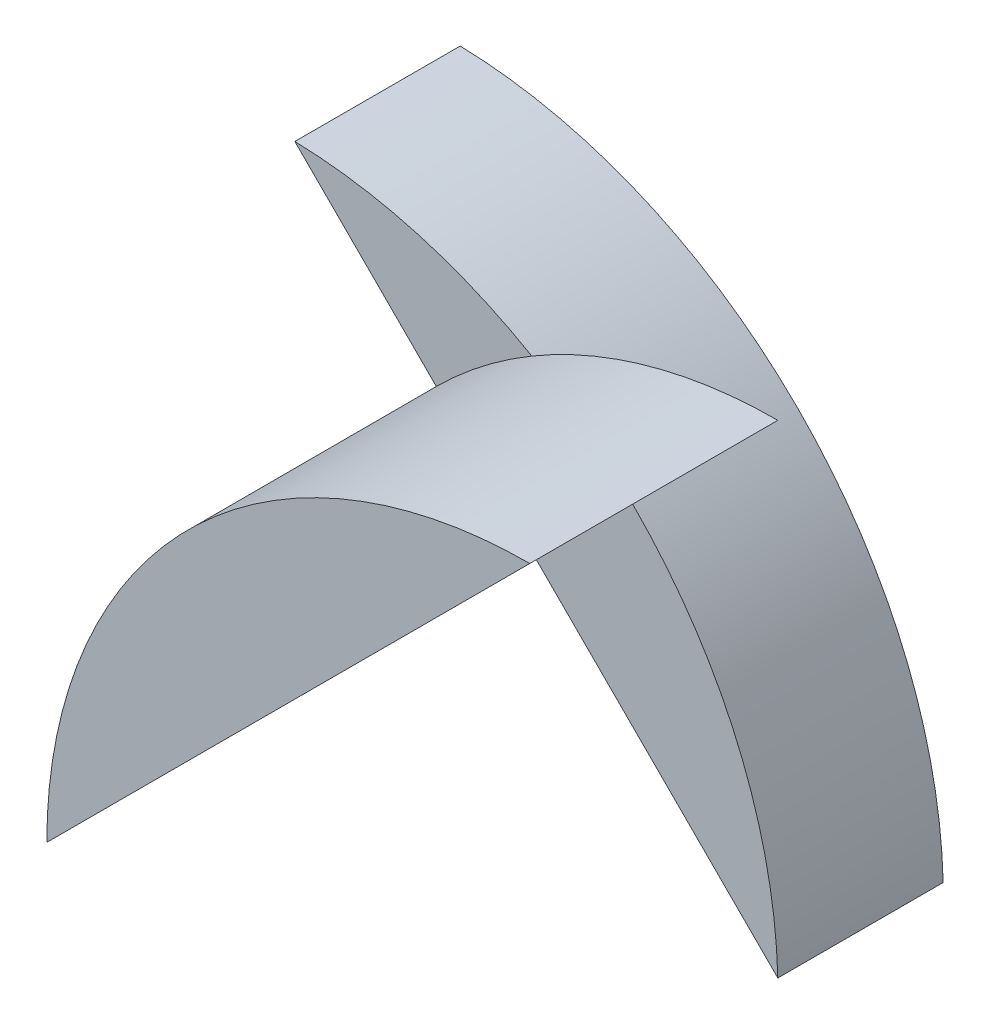
ISO-10303-21;
HEADER;
FILE_DESCRIPTION(('STEP AP214'),'2;1');
FILE_NAME('part.step','',(''),(''),'','','');
FILE_SCHEMA(('AUTOMOTIVE_DESIGN { 1 0 10303 214 1 1 1 1 }'));
ENDSEC;
DATA;
#1=APPLICATION_CONTEXT('core data for automotive mechanical design processes');
#2=APPLICATION_PROTOCOL_DEFINITION('international standard','automotive_design',2000,#1);
#3=PRODUCT_CONTEXT('',#1,'mechanical');
#4=PRODUCT('Part','Part','',(#3));
#5=PRODUCT_RELATED_PRODUCT_CATEGORY('part','',(#4));
#6=PRODUCT_DEFINITION_FORMATION('','',#4);
#7=PRODUCT_DEFINITION_CONTEXT('part definition',#1,'design');
#8=PRODUCT_DEFINITION('design','',#6,#7);
#9=PRODUCT_DEFINITION_SHAPE('','',#8);
#10=(LENGTH_UNIT() NAMED_UNIT(*) SI_UNIT(.MILLI.,.METRE.));
#11=(NAMED_UNIT(*) PLANE_ANGLE_UNIT() SI_UNIT($,.RADIAN.));
#12=(NAMED_UNIT(*) SI_UNIT($,.STERADIAN.) SOLID_ANGLE_UNIT());
#13=UNCERTAINTY_MEASURE_WITH_UNIT(LENGTH_MEASURE(1.E-05),#10,'distance_accuracy_value','');
#14=(GEOMETRIC_REPRESENTATION_CONTEXT(3) GLOBAL_UNCERTAINTY_ASSIGNED_CONTEXT((#13)) GLOBAL_UNIT_ASSIGNED_CONTEXT((#10,
#11,#12)) REPRESENTATION_CONTEXT('',''));
#15=CARTESIAN_POINT('',(0.,0.,0.));
#16=DIRECTION('',(0.,0.,1.));
#17=DIRECTION('',(1.,0.,0.));
#18=AXIS2_PLACEMENT_3D('',#15,#16,#17);
#19=CARTESIAN_POINT('',(-74.8151546864958,0.818815331010466,10.));
#20=DIRECTION('',(0.,0.,-1.));
#21=DIRECTION('',(-1.,0.,0.));
#22=AXIS2_PLACEMENT_3D('',#19,#20,#21);
#23=PLANE('',#22);
#24=CARTESIAN_POINT('',(-44.8151546864958,1.60829453234042,10.));
#25=DIRECTION('',(0.,0.,1.));
#26=DIRECTION('',(-1.,0.,0.));
#27=AXIS2_PLACEMENT_3D('',#24,#25,#26);
#28=CIRCLE('',#27,29.21052079867);
#29=CARTESIAN_POINT('',(-59.6975162776474,26.7433266349607,10.));
#30=VERTEX_POINT('',#29);
#31=CARTESIAN_POINT('',(-65.4701120252262,22.2632518710706,10.));
#32=VERTEX_POINT('',#31);
#33=EDGE_CURVE('E11',#30,#32,#28,.T.);
#34=ORIENTED_EDGE('',*,*,#33,.F.);
#35=CARTESIAN_POINT('',(-74.8151546864958,0.818815331010466,10.));
#36=DIRECTION('',(0.,0.,1.));
#37=DIRECTION('',(-1.,0.,0.));
#38=AXIS2_PLACEMENT_3D('',#35,#36,#37);
#39=CIRCLE('',#38,30.0103861589506);
#40=CARTESIAN_POINT('',(-74.025675485166,30.8188153310105,10.));
#41=VERTEX_POINT('',#40);
#42=EDGE_CURVE('E122',#30,#41,#39,.T.);
#43=ORIENTED_EDGE('',*,*,#42,.T.);
#44=DIRECTION('',(0.707106781186549,-0.707106781186545,0.));
#45=VECTOR('',#44,1.);
#46=CARTESIAN_POINT('',(-74.025675485166,30.8188153310105,10.));
#47=LINE('',#46,#45);
#48=EDGE_CURVE('E123',#41,#32,#47,.T.);
#49=ORIENTED_EDGE('',*,*,#48,.T.);
#50=EDGE_LOOP('',(#34,#43,#49));
#51=FACE_BOUND('',#50,.T.);
#52=ADVANCED_FACE('F33',(#51),#23,.F.);
#53=DIRECTION('',(0.707106781186547,0.707106781186548,0.));
#54=VECTOR('',#53,1.);
#55=CARTESIAN_POINT('',(-74.0256754851659,1.60829453234042,10.));
#56=LINE('',#55,#54);
#57=CARTESIAN_POINT('',(-59.4204150858309,16.2135549316754,10.));
#58=VERTEX_POINT('',#57);
#59=CARTESIAN_POINT('',(-53.594607127475,22.0393628900313,10.));
#60=VERTEX_POINT('',#59);
#61=EDGE_CURVE('E42',#58,#60,#56,.T.);
#62=ORIENTED_EDGE('',*,*,#61,.F.);
#63=CARTESIAN_POINT('',(-44.8151546864958,1.60829453234042,10.));
#64=VERTEX_POINT('',#63);
#65=EDGE_CURVE('E120',#58,#64,#47,.T.);
#66=ORIENTED_EDGE('',*,*,#65,.T.);
#67=EDGE_CURVE('E118',#64,#60,#39,.T.);
#68=ORIENTED_EDGE('',*,*,#67,.T.);
#69=EDGE_LOOP('',(#62,#66,#68));
#70=FACE_BOUND('',#69,.T.);
#71=ADVANCED_FACE('F145',(#70),#23,.F.);
#72=CARTESIAN_POINT('',(-74.8151546864958,0.818815331010466,10.));
#73=DIRECTION('',(0.,0.,-1.));
#74=DIRECTION('',(-1.,0.,0.));
#75=AXIS2_PLACEMENT_3D('',#72,#73,#74);
#76=CYLINDRICAL_SURFACE('',#75,30.0103861589506);
#77=CARTESIAN_POINT('',(-74.8151546864958,0.818815331010466,0.));
#78=DIRECTION('',(0.,0.,1.));
#79=DIRECTION('',(-1.,0.,0.));
#80=AXIS2_PLACEMENT_3D('',#77,#78,#79);
#81=CIRCLE('',#80,30.0103861589506);
#82=CARTESIAN_POINT('',(-44.8151546864958,1.60829453234042,0.));
#83=VERTEX_POINT('',#82);
#84=CARTESIAN_POINT('',(-74.025675485166,30.8188153310105,0.));
#85=VERTEX_POINT('',#84);
#86=EDGE_CURVE('E110',#83,#85,#81,.T.);
#87=ORIENTED_EDGE('',*,*,#86,.T.);
#88=DIRECTION('',(0.,0.,-1.));
#89=VECTOR('',#88,1.);
#90=CARTESIAN_POINT('',(-74.025675485166,30.8188153310105,10.));
#91=LINE('',#90,#89);
#92=EDGE_CURVE('E37',#41,#85,#91,.T.);
#93=ORIENTED_EDGE('',*,*,#92,.F.);
#94=ORIENTED_EDGE('',*,*,#42,.F.);
#95=EDGE_CURVE('E121',#60,#30,#39,.T.);
#96=ORIENTED_EDGE('',*,*,#95,.F.);
#97=ORIENTED_EDGE('',*,*,#67,.F.);
#98=DIRECTION('',(0.,0.,-1.));
#99=VECTOR('',#98,1.);
#100=CARTESIAN_POINT('',(-44.8151546864958,1.60829453234042,10.));
#101=LINE('',#100,#99);
#102=EDGE_CURVE('E124',#64,#83,#101,.T.);
#103=ORIENTED_EDGE('',*,*,#102,.T.);
#104=EDGE_LOOP('',(#87,#93,#94,#96,#97,#103));
#105=FACE_BOUND('',#104,.T.);
#106=ADVANCED_FACE('F35',(#105),#76,.T.);
#107=CARTESIAN_POINT('',(-74.025675485166,30.8188153310105,10.));
#108=DIRECTION('',(0.707106781186546,0.70710678118655,0.));
#109=DIRECTION('',(-0.70710678118655,0.707106781186546,0.));
#110=AXIS2_PLACEMENT_3D('',#107,#108,#109);
#111=PLANE('',#110);
#112=DIRECTION('',(0.707106781186549,-0.707106781186545,0.));
#113=VECTOR('',#112,1.);
#114=CARTESIAN_POINT('',(-74.025675485166,30.8188153310105,0.));
#115=LINE('',#114,#113);
#116=EDGE_CURVE('E113',#85,#83,#115,.T.);
#117=ORIENTED_EDGE('',*,*,#116,.T.);
#118=ORIENTED_EDGE('',*,*,#102,.F.);
#119=ORIENTED_EDGE('',*,*,#65,.F.);
#120=EDGE_CURVE('E58',#32,#58,#47,.T.);
#121=ORIENTED_EDGE('',*,*,#120,.F.);
#122=ORIENTED_EDGE('',*,*,#48,.F.);
#123=ORIENTED_EDGE('',*,*,#92,.T.);
#124=EDGE_LOOP('',(#117,#118,#119,#121,#122,#123));
#125=FACE_BOUND('',#124,.T.);
#126=ADVANCED_FACE('F142',(#125),#111,.F.);
#127=CARTESIAN_POINT('',(-74.8151546864958,0.818815331010466,0.));
#128=DIRECTION('',(0.,0.,-1.));
#129=DIRECTION('',(-1.,0.,0.));
#130=AXIS2_PLACEMENT_3D('',#127,#128,#129);
#131=PLANE('',#130);
#132=ORIENTED_EDGE('',*,*,#86,.F.);
#133=ORIENTED_EDGE('',*,*,#116,.F.);
#134=EDGE_LOOP('',(#132,#133));
#135=FACE_BOUND('',#134,.T.);
#136=ADVANCED_FACE('F144',(#135),#131,.T.);
#137=CARTESIAN_POINT('',(-44.8151546864958,1.60829453234042,10.));
#138=DIRECTION('',(0.,0.,-1.));
#139=DIRECTION('',(-1.,0.,0.));
#140=AXIS2_PLACEMENT_3D('',#137,#138,#139);
#141=PLANE('',#140);
#142=CARTESIAN_POINT('',(-44.8151546864958,30.8188153310105,10.));
#143=VERTEX_POINT('',#142);
#144=EDGE_CURVE('E133',#60,#143,#56,.T.);
#145=ORIENTED_EDGE('',*,*,#144,.F.);
#146=ORIENTED_EDGE('',*,*,#95,.T.);
#147=EDGE_CURVE('E44',#143,#30,#28,.T.);
#148=ORIENTED_EDGE('',*,*,#147,.F.);
#149=EDGE_LOOP('',(#145,#146,#148));
#150=FACE_BOUND('',#149,.T.);
#151=ADVANCED_FACE('F138',(#150),#141,.T.);
#152=CARTESIAN_POINT('',(-44.8151546864958,1.60829453234042,25.));
#153=DIRECTION('',(0.,0.,-1.));
#154=DIRECTION('',(-1.,0.,0.));
#155=AXIS2_PLACEMENT_3D('',#152,#153,#154);
#156=CYLINDRICAL_SURFACE('',#155,29.21052079867);
#157=ORIENTED_EDGE('',*,*,#147,.T.);
#158=ORIENTED_EDGE('',*,*,#33,.T.);
#159=CARTESIAN_POINT('',(-74.0256754851659,1.60829453234042,10.));
#160=VERTEX_POINT('',#159);
#161=EDGE_CURVE('E45',#32,#160,#28,.T.);
#162=ORIENTED_EDGE('',*,*,#161,.T.);
#163=DIRECTION('',(0.,0.,-1.));
#164=VECTOR('',#163,1.);
#165=CARTESIAN_POINT('',(-74.0256754851659,1.60829453234042,25.));
#166=LINE('',#165,#164);
#167=CARTESIAN_POINT('',(-74.0256754851659,1.60829453234042,25.));
#168=VERTEX_POINT('',#167);
#169=EDGE_CURVE('E95',#168,#160,#166,.T.);
#170=ORIENTED_EDGE('',*,*,#169,.F.);
#171=CARTESIAN_POINT('',(-44.8151546864958,1.60829453234042,25.));
#172=DIRECTION('',(0.,0.,1.));
#173=DIRECTION('',(-1.,0.,0.));
#174=AXIS2_PLACEMENT_3D('',#171,#172,#173);
#175=CIRCLE('',#174,29.21052079867);
#176=CARTESIAN_POINT('',(-44.8151546864958,30.8188153310105,25.));
#177=VERTEX_POINT('',#176);
#178=EDGE_CURVE('E100',#177,#168,#175,.T.);
#179=ORIENTED_EDGE('',*,*,#178,.F.);
#180=DIRECTION('',(0.,0.,-1.));
#181=VECTOR('',#180,1.);
#182=CARTESIAN_POINT('',(-44.8151546864958,30.8188153310105,25.));
#183=LINE('',#182,#181);
#184=EDGE_CURVE('E97',#177,#143,#183,.T.);
#185=ORIENTED_EDGE('',*,*,#184,.T.);
#186=EDGE_LOOP('',(#157,#158,#162,#170,#179,#185));
#187=FACE_BOUND('',#186,.T.);
#188=ADVANCED_FACE('F107',(#187),#156,.T.);
#189=CARTESIAN_POINT('',(-74.0256754851659,1.60829453234042,25.));
#190=DIRECTION('',(-0.707106781186548,0.707106781186547,0.));
#191=DIRECTION('',(-0.707106781186547,-0.707106781186548,0.));
#192=AXIS2_PLACEMENT_3D('',#189,#190,#191);
#193=PLANE('',#192);
#194=EDGE_CURVE('E104',#160,#58,#56,.T.);
#195=ORIENTED_EDGE('',*,*,#194,.T.);
#196=ORIENTED_EDGE('',*,*,#61,.T.);
#197=ORIENTED_EDGE('',*,*,#144,.T.);
#198=ORIENTED_EDGE('',*,*,#184,.F.);
#199=DIRECTION('',(0.707106781186547,0.707106781186548,0.));
#200=VECTOR('',#199,1.);
#201=CARTESIAN_POINT('',(-74.0256754851659,1.60829453234042,25.));
#202=LINE('',#201,#200);
#203=EDGE_CURVE('E90',#168,#177,#202,.T.);
#204=ORIENTED_EDGE('',*,*,#203,.F.);
#205=ORIENTED_EDGE('',*,*,#169,.T.);
#206=EDGE_LOOP('',(#195,#196,#197,#198,#204,#205));
#207=FACE_BOUND('',#206,.T.);
#208=ADVANCED_FACE('F93',(#207),#193,.F.);
#209=CARTESIAN_POINT('',(-44.8151546864958,1.60829453234042,25.));
#210=DIRECTION('',(0.,0.,-1.));
#211=DIRECTION('',(-1.,0.,0.));
#212=AXIS2_PLACEMENT_3D('',#209,#210,#211);
#213=PLANE('',#212);
#214=ORIENTED_EDGE('',*,*,#178,.T.);
#215=ORIENTED_EDGE('',*,*,#203,.T.);
#216=EDGE_LOOP('',(#214,#215));
#217=FACE_BOUND('',#216,.T.);
#218=ADVANCED_FACE('F102',(#217),#213,.F.);
#219=ORIENTED_EDGE('',*,*,#161,.F.);
#220=ORIENTED_EDGE('',*,*,#120,.T.);
#221=ORIENTED_EDGE('',*,*,#194,.F.);
#222=EDGE_LOOP('',(#219,#220,#221));
#223=FACE_BOUND('',#222,.T.);
#224=ADVANCED_FACE('F147',(#223),#141,.T.);
#225=CLOSED_SHELL('',(#52,#71,#106,#126,#136,#151,#188,#208,#218,#224));
#226=MANIFOLD_SOLID_BREP('B2',#225);
#227=ADVANCED_BREP_SHAPE_REPRESENTATION('',(#18,#226),#14);
#228=SHAPE_DEFINITION_REPRESENTATION(#9,#227);
ENDSEC;
END-ISO-10303-21;
